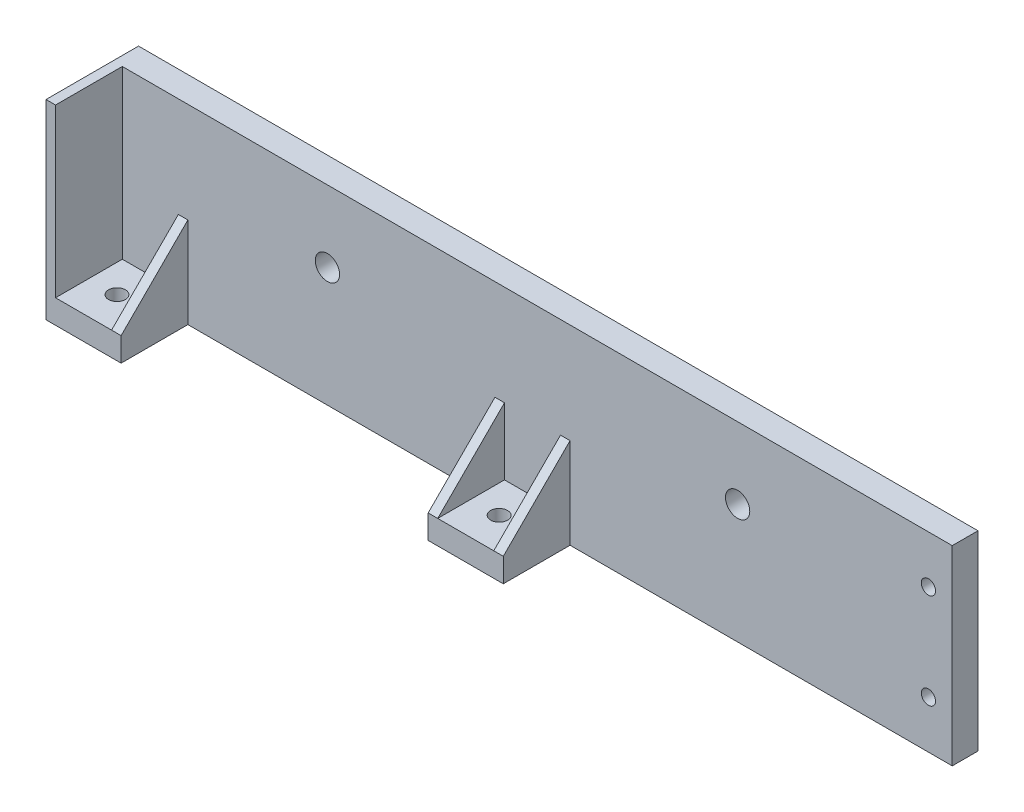
ISO-10303-21;
HEADER;
FILE_DESCRIPTION(('STEP AP214'),'2;1');
FILE_NAME('part.step','',(''),(''),'','','');
FILE_SCHEMA(('AUTOMOTIVE_DESIGN { 1 0 10303 214 1 1 1 1 }'));
ENDSEC;
DATA;
#1=APPLICATION_CONTEXT('core data for automotive mechanical design processes');
#2=APPLICATION_PROTOCOL_DEFINITION('international standard','automotive_design',2000,#1);
#3=PRODUCT_CONTEXT('',#1,'mechanical');
#4=PRODUCT('Part','Part','',(#3));
#5=PRODUCT_RELATED_PRODUCT_CATEGORY('part','',(#4));
#6=PRODUCT_DEFINITION_FORMATION('','',#4);
#7=PRODUCT_DEFINITION_CONTEXT('part definition',#1,'design');
#8=PRODUCT_DEFINITION('design','',#6,#7);
#9=PRODUCT_DEFINITION_SHAPE('','',#8);
#10=(LENGTH_UNIT() NAMED_UNIT(*) SI_UNIT(.MILLI.,.METRE.));
#11=(NAMED_UNIT(*) PLANE_ANGLE_UNIT() SI_UNIT($,.RADIAN.));
#12=(NAMED_UNIT(*) SI_UNIT($,.STERADIAN.) SOLID_ANGLE_UNIT());
#13=UNCERTAINTY_MEASURE_WITH_UNIT(LENGTH_MEASURE(1.E-05),#10,'distance_accuracy_value','');
#14=(GEOMETRIC_REPRESENTATION_CONTEXT(3) GLOBAL_UNCERTAINTY_ASSIGNED_CONTEXT((#13)) GLOBAL_UNIT_ASSIGNED_CONTEXT((#10,
#11,#12)) REPRESENTATION_CONTEXT('',''));
#15=CARTESIAN_POINT('',(0.,0.,0.));
#16=DIRECTION('',(0.,0.,1.));
#17=DIRECTION('',(1.,0.,0.));
#18=AXIS2_PLACEMENT_3D('',#15,#16,#17);
#19=CARTESIAN_POINT('',(0.,0.,6.858));
#20=DIRECTION('',(0.,0.,1.));
#21=DIRECTION('',(1.,0.,0.));
#22=AXIS2_PLACEMENT_3D('',#19,#20,#21);
#23=PLANE('',#22);
#24=CARTESIAN_POINT('',(105.41,12.7,6.858));
#25=DIRECTION('',(0.,0.,1.));
#26=DIRECTION('',(1.,0.,0.));
#27=AXIS2_PLACEMENT_3D('',#24,#25,#26);
#28=CIRCLE('',#27,1.89864999999999);
#29=CARTESIAN_POINT('',(107.30865,12.7,6.858));
#30=VERTEX_POINT('',#29);
#31=EDGE_CURVE('E40',#30,#30,#28,.T.);
#32=ORIENTED_EDGE('',*,*,#31,.F.);
#33=EDGE_LOOP('',(#32));
#34=FACE_BOUND('',#33,.T.);
#35=CARTESIAN_POINT('',(105.41,-12.7,6.858));
#36=DIRECTION('',(0.,0.,1.));
#37=DIRECTION('',(1.,0.,0.));
#38=AXIS2_PLACEMENT_3D('',#35,#36,#37);
#39=CIRCLE('',#38,1.89864999999999);
#40=CARTESIAN_POINT('',(107.30865,-12.7,6.858));
#41=VERTEX_POINT('',#40);
#42=EDGE_CURVE('E177',#41,#41,#39,.T.);
#43=ORIENTED_EDGE('',*,*,#42,.F.);
#44=EDGE_LOOP('',(#43));
#45=FACE_BOUND('',#44,.T.);
#46=CARTESIAN_POINT('',(-54.61,6.34999999999994,6.858));
#47=DIRECTION('',(0.,0.,1.));
#48=DIRECTION('',(1.,0.,0.));
#49=AXIS2_PLACEMENT_3D('',#46,#47,#48);
#50=CIRCLE('',#49,3.2385);
#51=CARTESIAN_POINT('',(-51.3715,6.34999999999994,6.858));
#52=VERTEX_POINT('',#51);
#53=EDGE_CURVE('E281',#52,#52,#50,.T.);
#54=ORIENTED_EDGE('',*,*,#53,.F.);
#55=EDGE_LOOP('',(#54));
#56=FACE_BOUND('',#55,.T.);
#57=CARTESIAN_POINT('',(54.61,6.35,6.858));
#58=DIRECTION('',(0.,0.,1.));
#59=DIRECTION('',(1.,0.,0.));
#60=AXIS2_PLACEMENT_3D('',#57,#58,#59);
#61=CIRCLE('',#60,3.2385);
#62=CARTESIAN_POINT('',(57.8485,6.35,6.858));
#63=VERTEX_POINT('',#62);
#64=EDGE_CURVE('E292',#63,#63,#61,.T.);
#65=ORIENTED_EDGE('',*,*,#64,.F.);
#66=EDGE_LOOP('',(#65));
#67=FACE_BOUND('',#66,.T.);
#68=DIRECTION('',(1.,0.,0.));
#69=VECTOR('',#68,1.);
#70=CARTESIAN_POINT('',(0.,25.4,6.858));
#71=LINE('',#70,#69);
#72=CARTESIAN_POINT('',(-109.22,25.4,6.858));
#73=VERTEX_POINT('',#72);
#74=CARTESIAN_POINT('',(111.76,25.4,6.858));
#75=VERTEX_POINT('',#74);
#76=EDGE_CURVE('E284',#73,#75,#71,.T.);
#77=ORIENTED_EDGE('',*,*,#76,.F.);
#78=DIRECTION('',(0.,-1.,0.));
#79=VECTOR('',#78,1.);
#80=CARTESIAN_POINT('',(-109.22,-1.27000000000001,6.858));
#81=LINE('',#80,#79);
#82=CARTESIAN_POINT('',(-109.22,-19.05,6.858));
#83=VERTEX_POINT('',#82);
#84=EDGE_CURVE('E261',#73,#83,#81,.T.);
#85=ORIENTED_EDGE('',*,*,#84,.T.);
#86=DIRECTION('',(-1.,0.,0.));
#87=VECTOR('',#86,1.);
#88=CARTESIAN_POINT('',(-111.76,-19.05,6.858));
#89=LINE('',#88,#87);
#90=CARTESIAN_POINT('',(-94.3,-19.05,6.858));
#91=VERTEX_POINT('',#90);
#92=EDGE_CURVE('E170',#91,#83,#89,.T.);
#93=ORIENTED_EDGE('',*,*,#92,.F.);
#94=DIRECTION('',(0.,-1.,0.));
#95=VECTOR('',#94,1.);
#96=CARTESIAN_POINT('',(-94.3,-1.27000000000001,6.858));
#97=LINE('',#96,#95);
#98=CARTESIAN_POINT('',(-94.3,-1.27000000000001,6.858));
#99=VERTEX_POINT('',#98);
#100=EDGE_CURVE('E254',#99,#91,#97,.T.);
#101=ORIENTED_EDGE('',*,*,#100,.F.);
#102=DIRECTION('',(-1.,0.,0.));
#103=VECTOR('',#102,1.);
#104=CARTESIAN_POINT('',(-91.76,-1.27000000000001,6.858));
#105=LINE('',#104,#103);
#106=CARTESIAN_POINT('',(-91.76,-1.27000000000001,6.858));
#107=VERTEX_POINT('',#106);
#108=EDGE_CURVE('E252',#107,#99,#105,.T.);
#109=ORIENTED_EDGE('',*,*,#108,.F.);
#110=DIRECTION('',(0.,1.,0.));
#111=VECTOR('',#110,1.);
#112=CARTESIAN_POINT('',(-91.76,-25.4,6.858));
#113=LINE('',#112,#111);
#114=CARTESIAN_POINT('',(-91.76,-25.4,6.858));
#115=VERTEX_POINT('',#114);
#116=EDGE_CURVE('E58',#115,#107,#113,.T.);
#117=ORIENTED_EDGE('',*,*,#116,.F.);
#118=DIRECTION('',(1.,0.,0.));
#119=VECTOR('',#118,1.);
#120=CARTESIAN_POINT('',(0.,-25.4,6.858));
#121=LINE('',#120,#119);
#122=CARTESIAN_POINT('',(-10.,-25.4,6.858));
#123=VERTEX_POINT('',#122);
#124=EDGE_CURVE('E53',#115,#123,#121,.T.);
#125=ORIENTED_EDGE('',*,*,#124,.T.);
#126=DIRECTION('',(0.,-1.,0.));
#127=VECTOR('',#126,1.);
#128=CARTESIAN_POINT('',(-10.,-25.4,6.858));
#129=LINE('',#128,#127);
#130=CARTESIAN_POINT('',(-10.,-1.27000000000001,6.858));
#131=VERTEX_POINT('',#130);
#132=EDGE_CURVE('E220',#131,#123,#129,.T.);
#133=ORIENTED_EDGE('',*,*,#132,.F.);
#134=DIRECTION('',(-1.,0.,0.));
#135=VECTOR('',#134,1.);
#136=CARTESIAN_POINT('',(-10.,-1.27000000000001,6.858));
#137=LINE('',#136,#135);
#138=CARTESIAN_POINT('',(-7.46000000000002,-1.27000000000001,6.858));
#139=VERTEX_POINT('',#138);
#140=EDGE_CURVE('E207',#139,#131,#137,.T.);
#141=ORIENTED_EDGE('',*,*,#140,.F.);
#142=DIRECTION('',(0.,-1.,0.));
#143=VECTOR('',#142,1.);
#144=CARTESIAN_POINT('',(-7.46000000000002,-1.27000000000001,6.858));
#145=LINE('',#144,#143);
#146=CARTESIAN_POINT('',(-7.46000000000002,-19.05,6.858));
#147=VERTEX_POINT('',#146);
#148=EDGE_CURVE('E209',#139,#147,#145,.T.);
#149=ORIENTED_EDGE('',*,*,#148,.T.);
#150=DIRECTION('',(-1.,0.,0.));
#151=VECTOR('',#150,1.);
#152=CARTESIAN_POINT('',(-10.,-19.05,6.858));
#153=LINE('',#152,#151);
#154=CARTESIAN_POINT('',(7.45999999999998,-19.05,6.858));
#155=VERTEX_POINT('',#154);
#156=EDGE_CURVE('E224',#155,#147,#153,.T.);
#157=ORIENTED_EDGE('',*,*,#156,.F.);
#158=DIRECTION('',(0.,-1.,0.));
#159=VECTOR('',#158,1.);
#160=CARTESIAN_POINT('',(7.45999999999998,-1.27000000000001,6.858));
#161=LINE('',#160,#159);
#162=CARTESIAN_POINT('',(7.45999999999998,-1.27000000000001,6.858));
#163=VERTEX_POINT('',#162);
#164=EDGE_CURVE('E202',#163,#155,#161,.T.);
#165=ORIENTED_EDGE('',*,*,#164,.F.);
#166=DIRECTION('',(-1.,0.,0.));
#167=VECTOR('',#166,1.);
#168=CARTESIAN_POINT('',(9.99999999999998,-1.27000000000001,6.858));
#169=LINE('',#168,#167);
#170=CARTESIAN_POINT('',(9.99999999999998,-1.27000000000001,6.858));
#171=VERTEX_POINT('',#170);
#172=EDGE_CURVE('E200',#171,#163,#169,.T.);
#173=ORIENTED_EDGE('',*,*,#172,.F.);
#174=DIRECTION('',(0.,1.,0.));
#175=VECTOR('',#174,1.);
#176=CARTESIAN_POINT('',(9.99999999999998,-25.4,6.858));
#177=LINE('',#176,#175);
#178=CARTESIAN_POINT('',(9.99999999999998,-25.4,6.858));
#179=VERTEX_POINT('',#178);
#180=EDGE_CURVE('E235',#179,#171,#177,.T.);
#181=ORIENTED_EDGE('',*,*,#180,.F.);
#182=CARTESIAN_POINT('',(111.76,-25.4,6.858));
#183=VERTEX_POINT('',#182);
#184=EDGE_CURVE('E287',#179,#183,#121,.T.);
#185=ORIENTED_EDGE('',*,*,#184,.T.);
#186=DIRECTION('',(0.,1.,0.));
#187=VECTOR('',#186,1.);
#188=CARTESIAN_POINT('',(111.76,0.,6.858));
#189=LINE('',#188,#187);
#190=EDGE_CURVE('E289',#183,#75,#189,.T.);
#191=ORIENTED_EDGE('',*,*,#190,.T.);
#192=EDGE_LOOP('',(#77,#85,#93,#101,#109,#117,#125,#133,#141,#149,#157,#165,#173,#181,#185,#191));
#193=FACE_BOUND('',#192,.T.);
#194=ADVANCED_FACE('F36',(#34,#45,#56,#67,#193),#23,.T.);
#195=CARTESIAN_POINT('',(-10.,-19.05,24.638));
#196=DIRECTION('',(0.,-1.,0.));
#197=DIRECTION('',(0.,0.,-1.));
#198=AXIS2_PLACEMENT_3D('',#195,#196,#197);
#199=PLANE('',#198);
#200=CARTESIAN_POINT('',(0.,-19.05,15.748));
#201=DIRECTION('',(0.,1.,0.));
#202=DIRECTION('',(0.,0.,1.));
#203=AXIS2_PLACEMENT_3D('',#200,#201,#202);
#204=CIRCLE('',#203,2.25);
#205=CARTESIAN_POINT('',(0.,-19.05,17.998));
#206=VERTEX_POINT('',#205);
#207=EDGE_CURVE('E214',#206,#206,#204,.T.);
#208=ORIENTED_EDGE('',*,*,#207,.F.);
#209=EDGE_LOOP('',(#208));
#210=FACE_BOUND('',#209,.T.);
#211=DIRECTION('',(0.,0.,1.));
#212=VECTOR('',#211,1.);
#213=CARTESIAN_POINT('',(7.45999999999998,-19.05,24.638));
#214=LINE('',#213,#212);
#215=CARTESIAN_POINT('',(7.45999999999998,-19.05,24.638));
#216=VERTEX_POINT('',#215);
#217=EDGE_CURVE('E199',#155,#216,#214,.T.);
#218=ORIENTED_EDGE('',*,*,#217,.F.);
#219=ORIENTED_EDGE('',*,*,#156,.T.);
#220=DIRECTION('',(0.,0.,-1.));
#221=VECTOR('',#220,1.);
#222=CARTESIAN_POINT('',(-7.46000000000002,-19.05,24.638));
#223=LINE('',#222,#221);
#224=CARTESIAN_POINT('',(-7.46000000000002,-19.05,24.638));
#225=VERTEX_POINT('',#224);
#226=EDGE_CURVE('E206',#225,#147,#223,.T.);
#227=ORIENTED_EDGE('',*,*,#226,.F.);
#228=DIRECTION('',(-1.,0.,0.));
#229=VECTOR('',#228,1.);
#230=CARTESIAN_POINT('',(-10.,-19.05,24.638));
#231=LINE('',#230,#229);
#232=EDGE_CURVE('E229',#216,#225,#231,.T.);
#233=ORIENTED_EDGE('',*,*,#232,.F.);
#234=EDGE_LOOP('',(#218,#219,#227,#233));
#235=FACE_BOUND('',#234,.T.);
#236=ADVANCED_FACE('F354',(#210,#235),#199,.F.);
#237=CARTESIAN_POINT('',(-111.76,-19.05,24.638));
#238=DIRECTION('',(0.,-1.,0.));
#239=DIRECTION('',(0.,0.,-1.));
#240=AXIS2_PLACEMENT_3D('',#237,#238,#239);
#241=PLANE('',#240);
#242=CARTESIAN_POINT('',(-101.76,-19.05,15.748));
#243=DIRECTION('',(0.,1.,0.));
#244=DIRECTION('',(0.,0.,1.));
#245=AXIS2_PLACEMENT_3D('',#242,#243,#244);
#246=CIRCLE('',#245,2.25);
#247=CARTESIAN_POINT('',(-101.76,-19.05,17.998));
#248=VERTEX_POINT('',#247);
#249=EDGE_CURVE('E264',#248,#248,#246,.T.);
#250=ORIENTED_EDGE('',*,*,#249,.F.);
#251=EDGE_LOOP('',(#250));
#252=FACE_BOUND('',#251,.T.);
#253=DIRECTION('',(0.,0.,1.));
#254=VECTOR('',#253,1.);
#255=CARTESIAN_POINT('',(-94.3,-19.05,24.638));
#256=LINE('',#255,#254);
#257=CARTESIAN_POINT('',(-94.3,-19.05,24.638));
#258=VERTEX_POINT('',#257);
#259=EDGE_CURVE('E251',#91,#258,#256,.T.);
#260=ORIENTED_EDGE('',*,*,#259,.F.);
#261=ORIENTED_EDGE('',*,*,#92,.T.);
#262=DIRECTION('',(0.,0.,-1.));
#263=VECTOR('',#262,1.);
#264=CARTESIAN_POINT('',(-109.22,-19.05,24.638));
#265=LINE('',#264,#263);
#266=CARTESIAN_POINT('',(-109.22,-19.05,24.638));
#267=VERTEX_POINT('',#266);
#268=EDGE_CURVE('E258',#267,#83,#265,.T.);
#269=ORIENTED_EDGE('',*,*,#268,.F.);
#270=DIRECTION('',(-1.,0.,0.));
#271=VECTOR('',#270,1.);
#272=CARTESIAN_POINT('',(-111.76,-19.05,24.638));
#273=LINE('',#272,#271);
#274=EDGE_CURVE('E273',#258,#267,#273,.T.);
#275=ORIENTED_EDGE('',*,*,#274,.F.);
#276=EDGE_LOOP('',(#260,#261,#269,#275));
#277=FACE_BOUND('',#276,.T.);
#278=ADVANCED_FACE('F374',(#252,#277),#241,.F.);
#279=CARTESIAN_POINT('',(0.,25.4,6.858));
#280=DIRECTION('',(0.,1.,0.));
#281=DIRECTION('',(0.,0.,1.));
#282=AXIS2_PLACEMENT_3D('',#279,#280,#281);
#283=PLANE('',#282);
#284=DIRECTION('',(1.,0.,0.));
#285=VECTOR('',#284,1.);
#286=CARTESIAN_POINT('',(0.,25.4,0.));
#287=LINE('',#286,#285);
#288=CARTESIAN_POINT('',(-111.76,25.4,0.));
#289=VERTEX_POINT('',#288);
#290=CARTESIAN_POINT('',(111.76,25.4,0.));
#291=VERTEX_POINT('',#290);
#292=EDGE_CURVE('E160',#289,#291,#287,.T.);
#293=ORIENTED_EDGE('',*,*,#292,.F.);
#294=DIRECTION('',(0.,0.,-1.));
#295=VECTOR('',#294,1.);
#296=CARTESIAN_POINT('',(-111.76,25.4,6.858));
#297=LINE('',#296,#295);
#298=CARTESIAN_POINT('',(-111.76,25.4,24.638));
#299=VERTEX_POINT('',#298);
#300=EDGE_CURVE('E11',#299,#289,#297,.T.);
#301=ORIENTED_EDGE('',*,*,#300,.F.);
#302=DIRECTION('',(-1.,0.,0.));
#303=VECTOR('',#302,1.);
#304=CARTESIAN_POINT('',(-61.3458848645743,25.4,24.638));
#305=LINE('',#304,#303);
#306=CARTESIAN_POINT('',(-109.22,25.4,24.638));
#307=VERTEX_POINT('',#306);
#308=EDGE_CURVE('E157',#307,#299,#305,.T.);
#309=ORIENTED_EDGE('',*,*,#308,.F.);
#310=DIRECTION('',(0.,0.,1.));
#311=VECTOR('',#310,1.);
#312=CARTESIAN_POINT('',(-109.22,25.4,6.858));
#313=LINE('',#312,#311);
#314=EDGE_CURVE('E176',#73,#307,#313,.T.);
#315=ORIENTED_EDGE('',*,*,#314,.F.);
#316=ORIENTED_EDGE('',*,*,#76,.T.);
#317=DIRECTION('',(0.,0.,-1.));
#318=VECTOR('',#317,1.);
#319=CARTESIAN_POINT('',(111.76,25.4,6.858));
#320=LINE('',#319,#318);
#321=EDGE_CURVE('E295',#75,#291,#320,.T.);
#322=ORIENTED_EDGE('',*,*,#321,.T.);
#323=EDGE_LOOP('',(#293,#301,#309,#315,#316,#322));
#324=FACE_BOUND('',#323,.T.);
#325=ADVANCED_FACE('F154',(#324),#283,.T.);
#326=CARTESIAN_POINT('',(-111.76,0.,6.858));
#327=DIRECTION('',(-1.,0.,0.));
#328=DIRECTION('',(0.,0.,1.));
#329=AXIS2_PLACEMENT_3D('',#326,#327,#328);
#330=PLANE('',#329);
#331=DIRECTION('',(0.,-1.,0.));
#332=VECTOR('',#331,1.);
#333=CARTESIAN_POINT('',(-111.76,-25.4,24.638));
#334=LINE('',#333,#332);
#335=CARTESIAN_POINT('',(-111.76,-25.4,24.638));
#336=VERTEX_POINT('',#335);
#337=EDGE_CURVE('E165',#299,#336,#334,.T.);
#338=ORIENTED_EDGE('',*,*,#337,.F.);
#339=ORIENTED_EDGE('',*,*,#300,.T.);
#340=DIRECTION('',(0.,1.,0.));
#341=VECTOR('',#340,1.);
#342=CARTESIAN_POINT('',(-111.76,0.,0.));
#343=LINE('',#342,#341);
#344=CARTESIAN_POINT('',(-111.76,-25.4,0.));
#345=VERTEX_POINT('',#344);
#346=EDGE_CURVE('E299',#345,#289,#343,.T.);
#347=ORIENTED_EDGE('',*,*,#346,.F.);
#348=DIRECTION('',(0.,0.,-1.));
#349=VECTOR('',#348,1.);
#350=CARTESIAN_POINT('',(-111.76,-25.4,6.858));
#351=LINE('',#350,#349);
#352=EDGE_CURVE('E45',#336,#345,#351,.T.);
#353=ORIENTED_EDGE('',*,*,#352,.F.);
#354=EDGE_LOOP('',(#338,#339,#347,#353));
#355=FACE_BOUND('',#354,.T.);
#356=ADVANCED_FACE('F166',(#355),#330,.T.);
#357=CARTESIAN_POINT('',(0.,-25.4,6.858));
#358=DIRECTION('',(0.,1.,0.));
#359=DIRECTION('',(0.,0.,1.));
#360=AXIS2_PLACEMENT_3D('',#357,#358,#359);
#361=PLANE('',#360);
#362=CARTESIAN_POINT('',(0.,-25.4,15.748));
#363=DIRECTION('',(0.,1.,0.));
#364=DIRECTION('',(0.,0.,1.));
#365=AXIS2_PLACEMENT_3D('',#362,#363,#364);
#366=CIRCLE('',#365,2.25);
#367=CARTESIAN_POINT('',(0.,-25.4,17.998));
#368=VERTEX_POINT('',#367);
#369=EDGE_CURVE('E217',#368,#368,#366,.T.);
#370=ORIENTED_EDGE('',*,*,#369,.T.);
#371=EDGE_LOOP('',(#370));
#372=FACE_BOUND('',#371,.T.);
#373=CARTESIAN_POINT('',(-101.76,-25.4,15.748));
#374=DIRECTION('',(0.,1.,0.));
#375=DIRECTION('',(0.,0.,1.));
#376=AXIS2_PLACEMENT_3D('',#373,#374,#375);
#377=CIRCLE('',#376,2.25);
#378=CARTESIAN_POINT('',(-101.76,-25.4,17.998));
#379=VERTEX_POINT('',#378);
#380=EDGE_CURVE('E267',#379,#379,#377,.T.);
#381=ORIENTED_EDGE('',*,*,#380,.T.);
#382=EDGE_LOOP('',(#381));
#383=FACE_BOUND('',#382,.T.);
#384=DIRECTION('',(1.,0.,0.));
#385=VECTOR('',#384,1.);
#386=CARTESIAN_POINT('',(0.,-25.4,0.));
#387=LINE('',#386,#385);
#388=CARTESIAN_POINT('',(111.76,-25.4,0.));
#389=VERTEX_POINT('',#388);
#390=EDGE_CURVE('E301',#345,#389,#387,.T.);
#391=ORIENTED_EDGE('',*,*,#390,.T.);
#392=DIRECTION('',(0.,0.,-1.));
#393=VECTOR('',#392,1.);
#394=CARTESIAN_POINT('',(111.76,-25.4,6.858));
#395=LINE('',#394,#393);
#396=EDGE_CURVE('E310',#183,#389,#395,.T.);
#397=ORIENTED_EDGE('',*,*,#396,.F.);
#398=ORIENTED_EDGE('',*,*,#184,.F.);
#399=DIRECTION('',(0.,0.,-1.));
#400=VECTOR('',#399,1.);
#401=CARTESIAN_POINT('',(9.99999999999998,-25.4,24.638));
#402=LINE('',#401,#400);
#403=CARTESIAN_POINT('',(9.99999999999998,-25.4,24.638));
#404=VERTEX_POINT('',#403);
#405=EDGE_CURVE('E232',#404,#179,#402,.T.);
#406=ORIENTED_EDGE('',*,*,#405,.F.);
#407=DIRECTION('',(1.,0.,0.));
#408=VECTOR('',#407,1.);
#409=CARTESIAN_POINT('',(-10.,-25.4,24.638));
#410=LINE('',#409,#408);
#411=CARTESIAN_POINT('',(-10.,-25.4,24.638));
#412=VERTEX_POINT('',#411);
#413=EDGE_CURVE('E223',#412,#404,#410,.T.);
#414=ORIENTED_EDGE('',*,*,#413,.F.);
#415=DIRECTION('',(0.,0.,-1.));
#416=VECTOR('',#415,1.);
#417=CARTESIAN_POINT('',(-10.,-25.4,24.638));
#418=LINE('',#417,#416);
#419=EDGE_CURVE('E241',#412,#123,#418,.T.);
#420=ORIENTED_EDGE('',*,*,#419,.T.);
#421=ORIENTED_EDGE('',*,*,#124,.F.);
#422=DIRECTION('',(0.,0.,-1.));
#423=VECTOR('',#422,1.);
#424=CARTESIAN_POINT('',(-91.76,-25.4,24.638));
#425=LINE('',#424,#423);
#426=CARTESIAN_POINT('',(-91.76,-25.4,24.638));
#427=VERTEX_POINT('',#426);
#428=EDGE_CURVE('E275',#427,#115,#425,.T.);
#429=ORIENTED_EDGE('',*,*,#428,.F.);
#430=DIRECTION('',(1.,0.,0.));
#431=VECTOR('',#430,1.);
#432=CARTESIAN_POINT('',(-111.76,-25.4,24.638));
#433=LINE('',#432,#431);
#434=EDGE_CURVE('E169',#336,#427,#433,.T.);
#435=ORIENTED_EDGE('',*,*,#434,.F.);
#436=ORIENTED_EDGE('',*,*,#352,.T.);
#437=EDGE_LOOP('',(#391,#397,#398,#406,#414,#420,#421,#429,#435,#436));
#438=FACE_BOUND('',#437,.T.);
#439=ADVANCED_FACE('F315',(#372,#383,#438),#361,.F.);
#440=CARTESIAN_POINT('',(111.76,0.,6.858));
#441=DIRECTION('',(-1.,0.,0.));
#442=DIRECTION('',(0.,0.,1.));
#443=AXIS2_PLACEMENT_3D('',#440,#441,#442);
#444=PLANE('',#443);
#445=DIRECTION('',(0.,1.,0.));
#446=VECTOR('',#445,1.);
#447=CARTESIAN_POINT('',(111.76,0.,0.));
#448=LINE('',#447,#446);
#449=EDGE_CURVE('E304',#389,#291,#448,.T.);
#450=ORIENTED_EDGE('',*,*,#449,.T.);
#451=ORIENTED_EDGE('',*,*,#321,.F.);
#452=ORIENTED_EDGE('',*,*,#190,.F.);
#453=ORIENTED_EDGE('',*,*,#396,.T.);
#454=EDGE_LOOP('',(#450,#451,#452,#453));
#455=FACE_BOUND('',#454,.T.);
#456=ADVANCED_FACE('F324',(#455),#444,.F.);
#457=CARTESIAN_POINT('',(-54.61,6.34999999999994,6.858));
#458=DIRECTION('',(0.,0.,-1.));
#459=DIRECTION('',(-1.,0.,0.));
#460=AXIS2_PLACEMENT_3D('',#457,#458,#459);
#461=CYLINDRICAL_SURFACE('',#460,3.2385);
#462=ORIENTED_EDGE('',*,*,#53,.T.);
#463=EDGE_LOOP('',(#462));
#464=FACE_BOUND('',#463,.T.);
#465=CARTESIAN_POINT('',(-54.61,6.34999999999994,0.));
#466=DIRECTION('',(0.,0.,1.));
#467=DIRECTION('',(1.,0.,0.));
#468=AXIS2_PLACEMENT_3D('',#465,#466,#467);
#469=CIRCLE('',#468,3.2385);
#470=CARTESIAN_POINT('',(-51.3715,6.34999999999994,0.));
#471=VERTEX_POINT('',#470);
#472=EDGE_CURVE('E280',#471,#471,#469,.T.);
#473=ORIENTED_EDGE('',*,*,#472,.F.);
#474=EDGE_LOOP('',(#473));
#475=FACE_BOUND('',#474,.T.);
#476=ADVANCED_FACE('F38',(#464,#475),#461,.F.);
#477=CARTESIAN_POINT('',(54.61,6.35,6.858));
#478=DIRECTION('',(0.,0.,-1.));
#479=DIRECTION('',(-1.,0.,0.));
#480=AXIS2_PLACEMENT_3D('',#477,#478,#479);
#481=CYLINDRICAL_SURFACE('',#480,3.2385);
#482=ORIENTED_EDGE('',*,*,#64,.T.);
#483=EDGE_LOOP('',(#482));
#484=FACE_BOUND('',#483,.T.);
#485=CARTESIAN_POINT('',(54.61,6.35,0.));
#486=DIRECTION('',(0.,0.,1.));
#487=DIRECTION('',(1.,0.,0.));
#488=AXIS2_PLACEMENT_3D('',#485,#486,#487);
#489=CIRCLE('',#488,3.2385);
#490=CARTESIAN_POINT('',(57.8485,6.35,0.));
#491=VERTEX_POINT('',#490);
#492=EDGE_CURVE('E285',#491,#491,#489,.T.);
#493=ORIENTED_EDGE('',*,*,#492,.F.);
#494=EDGE_LOOP('',(#493));
#495=FACE_BOUND('',#494,.T.);
#496=ADVANCED_FACE('F385',(#484,#495),#481,.F.);
#497=CARTESIAN_POINT('',(0.,0.,0.));
#498=DIRECTION('',(0.,0.,1.));
#499=DIRECTION('',(1.,0.,0.));
#500=AXIS2_PLACEMENT_3D('',#497,#498,#499);
#501=PLANE('',#500);
#502=CARTESIAN_POINT('',(105.41,12.7,0.));
#503=DIRECTION('',(0.,0.,-1.));
#504=DIRECTION('',(-1.,0.,0.));
#505=AXIS2_PLACEMENT_3D('',#502,#503,#504);
#506=CIRCLE('',#505,3.98489170000001);
#507=CARTESIAN_POINT('',(101.4251083,12.7,0.));
#508=VERTEX_POINT('',#507);
#509=EDGE_CURVE('E548',#508,#508,#506,.T.);
#510=ORIENTED_EDGE('',*,*,#509,.F.);
#511=EDGE_LOOP('',(#510));
#512=FACE_BOUND('',#511,.T.);
#513=CARTESIAN_POINT('',(105.41,-12.7,0.));
#514=DIRECTION('',(0.,0.,-1.));
#515=DIRECTION('',(-1.,0.,0.));
#516=AXIS2_PLACEMENT_3D('',#513,#514,#515);
#517=CIRCLE('',#516,3.98489169999999);
#518=CARTESIAN_POINT('',(101.4251083,-12.7,0.));
#519=VERTEX_POINT('',#518);
#520=EDGE_CURVE('E552',#519,#519,#517,.T.);
#521=ORIENTED_EDGE('',*,*,#520,.F.);
#522=EDGE_LOOP('',(#521));
#523=FACE_BOUND('',#522,.T.);
#524=ORIENTED_EDGE('',*,*,#472,.T.);
#525=EDGE_LOOP('',(#524));
#526=FACE_BOUND('',#525,.T.);
#527=ORIENTED_EDGE('',*,*,#292,.T.);
#528=ORIENTED_EDGE('',*,*,#449,.F.);
#529=ORIENTED_EDGE('',*,*,#390,.F.);
#530=ORIENTED_EDGE('',*,*,#346,.T.);
#531=EDGE_LOOP('',(#527,#528,#529,#530));
#532=FACE_BOUND('',#531,.T.);
#533=ORIENTED_EDGE('',*,*,#492,.T.);
#534=EDGE_LOOP('',(#533));
#535=FACE_BOUND('',#534,.T.);
#536=ADVANCED_FACE('F319',(#512,#523,#526,#532,#535),#501,.F.);
#537=CARTESIAN_POINT('',(-91.76,-25.4,24.638));
#538=DIRECTION('',(-1.,0.,0.));
#539=DIRECTION('',(0.,0.,1.));
#540=AXIS2_PLACEMENT_3D('',#537,#538,#539);
#541=PLANE('',#540);
#542=ORIENTED_EDGE('',*,*,#116,.T.);
#543=DIRECTION('',(0.,0.707106781186547,-0.707106781186548));
#544=VECTOR('',#543,1.);
#545=CARTESIAN_POINT('',(-91.76,-19.05,24.638));
#546=LINE('',#545,#544);
#547=CARTESIAN_POINT('',(-91.76,-19.05,24.638));
#548=VERTEX_POINT('',#547);
#549=EDGE_CURVE('E244',#548,#107,#546,.T.);
#550=ORIENTED_EDGE('',*,*,#549,.F.);
#551=DIRECTION('',(0.,1.,0.));
#552=VECTOR('',#551,1.);
#553=CARTESIAN_POINT('',(-91.76,-25.4,24.638));
#554=LINE('',#553,#552);
#555=EDGE_CURVE('E271',#427,#548,#554,.T.);
#556=ORIENTED_EDGE('',*,*,#555,.F.);
#557=ORIENTED_EDGE('',*,*,#428,.T.);
#558=EDGE_LOOP('',(#542,#550,#556,#557));
#559=FACE_BOUND('',#558,.T.);
#560=ADVANCED_FACE('F381',(#559),#541,.F.);
#561=CARTESIAN_POINT('',(0.,0.,24.638));
#562=DIRECTION('',(0.,0.,-1.));
#563=DIRECTION('',(-1.,0.,0.));
#564=AXIS2_PLACEMENT_3D('',#561,#562,#563);
#565=PLANE('',#564);
#566=ORIENTED_EDGE('',*,*,#555,.T.);
#567=DIRECTION('',(-1.,0.,0.));
#568=VECTOR('',#567,1.);
#569=CARTESIAN_POINT('',(-66.6152828610064,-19.05,24.638));
#570=LINE('',#569,#568);
#571=EDGE_CURVE('E243',#548,#258,#570,.T.);
#572=ORIENTED_EDGE('',*,*,#571,.T.);
#573=ORIENTED_EDGE('',*,*,#274,.T.);
#574=DIRECTION('',(0.,-1.,0.));
#575=VECTOR('',#574,1.);
#576=CARTESIAN_POINT('',(-109.22,-19.05,24.638));
#577=LINE('',#576,#575);
#578=EDGE_CURVE('E175',#307,#267,#577,.T.);
#579=ORIENTED_EDGE('',*,*,#578,.F.);
#580=ORIENTED_EDGE('',*,*,#308,.T.);
#581=ORIENTED_EDGE('',*,*,#337,.T.);
#582=ORIENTED_EDGE('',*,*,#434,.T.);
#583=EDGE_LOOP('',(#566,#572,#573,#579,#580,#581,#582));
#584=FACE_BOUND('',#583,.T.);
#585=ADVANCED_FACE('F173',(#584),#565,.F.);
#586=CARTESIAN_POINT('',(-101.76,-36.83,15.748));
#587=DIRECTION('',(0.,1.,0.));
#588=DIRECTION('',(0.,0.,1.));
#589=AXIS2_PLACEMENT_3D('',#586,#587,#588);
#590=CYLINDRICAL_SURFACE('',#589,2.25);
#591=ORIENTED_EDGE('',*,*,#249,.T.);
#592=EDGE_LOOP('',(#591));
#593=FACE_BOUND('',#592,.T.);
#594=ORIENTED_EDGE('',*,*,#380,.F.);
#595=EDGE_LOOP('',(#594));
#596=FACE_BOUND('',#595,.T.);
#597=ADVANCED_FACE('F408',(#593,#596),#590,.F.);
#598=CARTESIAN_POINT('',(-109.22,-1.27000000000001,24.638));
#599=DIRECTION('',(-1.,0.,0.));
#600=DIRECTION('',(0.,0.,1.));
#601=AXIS2_PLACEMENT_3D('',#598,#599,#600);
#602=PLANE('',#601);
#603=ORIENTED_EDGE('',*,*,#84,.F.);
#604=ORIENTED_EDGE('',*,*,#314,.T.);
#605=ORIENTED_EDGE('',*,*,#578,.T.);
#606=ORIENTED_EDGE('',*,*,#268,.T.);
#607=EDGE_LOOP('',(#603,#604,#605,#606));
#608=FACE_BOUND('',#607,.T.);
#609=ADVANCED_FACE('F411',(#608),#602,.F.);
#610=CARTESIAN_POINT('',(-94.3,-1.27000000000001,24.638));
#611=DIRECTION('',(1.,0.,0.));
#612=DIRECTION('',(0.,0.,-1.));
#613=AXIS2_PLACEMENT_3D('',#610,#611,#612);
#614=PLANE('',#613);
#615=ORIENTED_EDGE('',*,*,#259,.T.);
#616=DIRECTION('',(0.,0.707106781186547,-0.707106781186548));
#617=VECTOR('',#616,1.);
#618=CARTESIAN_POINT('',(-94.3,-10.16,15.748));
#619=LINE('',#618,#617);
#620=EDGE_CURVE('E246',#258,#99,#619,.T.);
#621=ORIENTED_EDGE('',*,*,#620,.T.);
#622=ORIENTED_EDGE('',*,*,#100,.T.);
#623=EDGE_LOOP('',(#615,#621,#622));
#624=FACE_BOUND('',#623,.T.);
#625=ADVANCED_FACE('F415',(#624),#614,.F.);
#626=CARTESIAN_POINT('',(-66.6152828610064,-19.05,24.638));
#627=DIRECTION('',(0.,-0.707106781186548,-0.707106781186547));
#628=DIRECTION('',(0.,0.707106781186547,-0.707106781186548));
#629=AXIS2_PLACEMENT_3D('',#626,#627,#628);
#630=PLANE('',#629);
#631=ORIENTED_EDGE('',*,*,#571,.F.);
#632=ORIENTED_EDGE('',*,*,#549,.T.);
#633=ORIENTED_EDGE('',*,*,#108,.T.);
#634=ORIENTED_EDGE('',*,*,#620,.F.);
#635=EDGE_LOOP('',(#631,#632,#633,#634));
#636=FACE_BOUND('',#635,.T.);
#637=ADVANCED_FACE('F419',(#636),#630,.F.);
#638=CARTESIAN_POINT('',(-10.,-25.4,24.638));
#639=DIRECTION('',(1.,0.,0.));
#640=DIRECTION('',(0.,0.,-1.));
#641=AXIS2_PLACEMENT_3D('',#638,#639,#640);
#642=PLANE('',#641);
#643=DIRECTION('',(0.,-1.,0.));
#644=VECTOR('',#643,1.);
#645=CARTESIAN_POINT('',(-10.,-25.4,24.638));
#646=LINE('',#645,#644);
#647=CARTESIAN_POINT('',(-10.,-19.05,24.638));
#648=VERTEX_POINT('',#647);
#649=EDGE_CURVE('E221',#648,#412,#646,.T.);
#650=ORIENTED_EDGE('',*,*,#649,.F.);
#651=DIRECTION('',(0.,-0.707106781186547,0.707106781186548));
#652=VECTOR('',#651,1.);
#653=CARTESIAN_POINT('',(-10.,-19.05,24.638));
#654=LINE('',#653,#652);
#655=EDGE_CURVE('E185',#131,#648,#654,.T.);
#656=ORIENTED_EDGE('',*,*,#655,.F.);
#657=ORIENTED_EDGE('',*,*,#132,.T.);
#658=ORIENTED_EDGE('',*,*,#419,.F.);
#659=EDGE_LOOP('',(#650,#656,#657,#658));
#660=FACE_BOUND('',#659,.T.);
#661=ADVANCED_FACE('F341',(#660),#642,.F.);
#662=CARTESIAN_POINT('',(9.99999999999998,-25.4,24.638));
#663=DIRECTION('',(-1.,0.,0.));
#664=DIRECTION('',(0.,0.,1.));
#665=AXIS2_PLACEMENT_3D('',#662,#663,#664);
#666=PLANE('',#665);
#667=ORIENTED_EDGE('',*,*,#180,.T.);
#668=DIRECTION('',(0.,0.707106781186547,-0.707106781186548));
#669=VECTOR('',#668,1.);
#670=CARTESIAN_POINT('',(9.99999999999998,-19.05,24.638));
#671=LINE('',#670,#669);
#672=CARTESIAN_POINT('',(9.99999999999998,-19.05,24.638));
#673=VERTEX_POINT('',#672);
#674=EDGE_CURVE('E186',#673,#171,#671,.T.);
#675=ORIENTED_EDGE('',*,*,#674,.F.);
#676=DIRECTION('',(0.,1.,0.));
#677=VECTOR('',#676,1.);
#678=CARTESIAN_POINT('',(9.99999999999998,-25.4,24.638));
#679=LINE('',#678,#677);
#680=EDGE_CURVE('E226',#404,#673,#679,.T.);
#681=ORIENTED_EDGE('',*,*,#680,.F.);
#682=ORIENTED_EDGE('',*,*,#405,.T.);
#683=EDGE_LOOP('',(#667,#675,#681,#682));
#684=FACE_BOUND('',#683,.T.);
#685=ADVANCED_FACE('F334',(#684),#666,.F.);
#686=CARTESIAN_POINT('',(101.76,0.,24.638));
#687=DIRECTION('',(0.,0.,-1.));
#688=DIRECTION('',(-1.,0.,0.));
#689=AXIS2_PLACEMENT_3D('',#686,#687,#688);
#690=PLANE('',#689);
#691=ORIENTED_EDGE('',*,*,#680,.T.);
#692=DIRECTION('',(-1.,0.,0.));
#693=VECTOR('',#692,1.);
#694=CARTESIAN_POINT('',(96.9047171389936,-19.05,24.638));
#695=LINE('',#694,#693);
#696=EDGE_CURVE('E189',#673,#216,#695,.T.);
#697=ORIENTED_EDGE('',*,*,#696,.T.);
#698=ORIENTED_EDGE('',*,*,#232,.T.);
#699=EDGE_CURVE('E191',#225,#648,#695,.T.);
#700=ORIENTED_EDGE('',*,*,#699,.T.);
#701=ORIENTED_EDGE('',*,*,#649,.T.);
#702=ORIENTED_EDGE('',*,*,#413,.T.);
#703=EDGE_LOOP('',(#691,#697,#698,#700,#701,#702));
#704=FACE_BOUND('',#703,.T.);
#705=ADVANCED_FACE('F336',(#704),#690,.F.);
#706=CARTESIAN_POINT('',(0.,-36.83,15.748));
#707=DIRECTION('',(0.,1.,0.));
#708=DIRECTION('',(0.,0.,1.));
#709=AXIS2_PLACEMENT_3D('',#706,#707,#708);
#710=CYLINDRICAL_SURFACE('',#709,2.25);
#711=ORIENTED_EDGE('',*,*,#207,.T.);
#712=EDGE_LOOP('',(#711));
#713=FACE_BOUND('',#712,.T.);
#714=ORIENTED_EDGE('',*,*,#369,.F.);
#715=EDGE_LOOP('',(#714));
#716=FACE_BOUND('',#715,.T.);
#717=ADVANCED_FACE('F430',(#713,#716),#710,.F.);
#718=CARTESIAN_POINT('',(-7.46000000000002,-1.27000000000001,24.638));
#719=DIRECTION('',(-1.,0.,0.));
#720=DIRECTION('',(0.,0.,1.));
#721=AXIS2_PLACEMENT_3D('',#718,#719,#720);
#722=PLANE('',#721);
#723=ORIENTED_EDGE('',*,*,#148,.F.);
#724=DIRECTION('',(0.,-0.707106781186547,0.707106781186548));
#725=VECTOR('',#724,1.);
#726=CARTESIAN_POINT('',(-7.46000000000002,-10.16,15.748));
#727=LINE('',#726,#725);
#728=EDGE_CURVE('E196',#139,#225,#727,.T.);
#729=ORIENTED_EDGE('',*,*,#728,.T.);
#730=ORIENTED_EDGE('',*,*,#226,.T.);
#731=EDGE_LOOP('',(#723,#729,#730));
#732=FACE_BOUND('',#731,.T.);
#733=ADVANCED_FACE('F349',(#732),#722,.F.);
#734=CARTESIAN_POINT('',(7.45999999999998,-1.27000000000001,24.638));
#735=DIRECTION('',(1.,0.,0.));
#736=DIRECTION('',(0.,0.,-1.));
#737=AXIS2_PLACEMENT_3D('',#734,#735,#736);
#738=PLANE('',#737);
#739=ORIENTED_EDGE('',*,*,#217,.T.);
#740=DIRECTION('',(0.,0.707106781186547,-0.707106781186548));
#741=VECTOR('',#740,1.);
#742=CARTESIAN_POINT('',(7.45999999999998,-10.16,15.748));
#743=LINE('',#742,#741);
#744=EDGE_CURVE('E188',#216,#163,#743,.T.);
#745=ORIENTED_EDGE('',*,*,#744,.T.);
#746=ORIENTED_EDGE('',*,*,#164,.T.);
#747=EDGE_LOOP('',(#739,#745,#746));
#748=FACE_BOUND('',#747,.T.);
#749=ADVANCED_FACE('F356',(#748),#738,.F.);
#750=CARTESIAN_POINT('',(96.9047171389936,-19.05,24.638));
#751=DIRECTION('',(0.,-0.707106781186548,-0.707106781186548));
#752=DIRECTION('',(0.,0.707106781186547,-0.707106781186548));
#753=AXIS2_PLACEMENT_3D('',#750,#751,#752);
#754=PLANE('',#753);
#755=ORIENTED_EDGE('',*,*,#696,.F.);
#756=ORIENTED_EDGE('',*,*,#674,.T.);
#757=ORIENTED_EDGE('',*,*,#172,.T.);
#758=ORIENTED_EDGE('',*,*,#744,.F.);
#759=EDGE_LOOP('',(#755,#756,#757,#758));
#760=FACE_BOUND('',#759,.T.);
#761=ADVANCED_FACE('F358',(#760),#754,.F.);
#762=ORIENTED_EDGE('',*,*,#140,.T.);
#763=ORIENTED_EDGE('',*,*,#655,.T.);
#764=ORIENTED_EDGE('',*,*,#699,.F.);
#765=ORIENTED_EDGE('',*,*,#728,.F.);
#766=EDGE_LOOP('',(#762,#763,#764,#765));
#767=FACE_BOUND('',#766,.T.);
#768=ADVANCED_FACE('F347',(#767),#754,.F.);
#769=CARTESIAN_POINT('',(105.41,-12.7,0.));
#770=DIRECTION('',(0.,0.,-1.));
#771=DIRECTION('',(-1.,0.,0.));
#772=AXIS2_PLACEMENT_3D('',#769,#770,#771);
#773=CYLINDRICAL_SURFACE('',#772,1.89864999999999);
#774=ORIENTED_EDGE('',*,*,#42,.T.);
#775=EDGE_LOOP('',(#774));
#776=FACE_BOUND('',#775,.T.);
#777=CARTESIAN_POINT('',(105.41,-12.7,2.39994654150705));
#778=DIRECTION('',(0.,0.,-1.));
#779=DIRECTION('',(-1.,0.,0.));
#780=AXIS2_PLACEMENT_3D('',#777,#778,#779);
#781=CIRCLE('',#780,1.89865);
#782=CARTESIAN_POINT('',(103.51135,-12.7,2.39994654150705));
#783=VERTEX_POINT('',#782);
#784=EDGE_CURVE('E181',#783,#783,#781,.T.);
#785=ORIENTED_EDGE('',*,*,#784,.T.);
#786=EDGE_LOOP('',(#785));
#787=FACE_BOUND('',#786,.T.);
#788=ADVANCED_FACE('F365',(#776,#787),#773,.F.);
#789=CARTESIAN_POINT('',(105.41,-12.7,0.));
#790=DIRECTION('',(0.,0.,-1.));
#791=DIRECTION('',(-1.,0.,0.));
#792=AXIS2_PLACEMENT_3D('',#789,#790,#791);
#793=CONICAL_SURFACE('',#792,3.98489169999999,0.715584993317672);
#794=ORIENTED_EDGE('',*,*,#784,.F.);
#795=EDGE_LOOP('',(#794));
#796=FACE_BOUND('',#795,.T.);
#797=ORIENTED_EDGE('',*,*,#520,.T.);
#798=EDGE_LOOP('',(#797));
#799=FACE_BOUND('',#798,.T.);
#800=ADVANCED_FACE('F509',(#796,#799),#793,.F.);
#801=CARTESIAN_POINT('',(105.41,12.7,0.));
#802=DIRECTION('',(0.,0.,-1.));
#803=DIRECTION('',(-1.,0.,0.));
#804=AXIS2_PLACEMENT_3D('',#801,#802,#803);
#805=CYLINDRICAL_SURFACE('',#804,1.89864999999999);
#806=ORIENTED_EDGE('',*,*,#31,.T.);
#807=EDGE_LOOP('',(#806));
#808=FACE_BOUND('',#807,.T.);
#809=CARTESIAN_POINT('',(105.41,12.7,2.39994654150705));
#810=DIRECTION('',(0.,0.,-1.));
#811=DIRECTION('',(-1.,0.,0.));
#812=AXIS2_PLACEMENT_3D('',#809,#810,#811);
#813=CIRCLE('',#812,1.89865);
#814=CARTESIAN_POINT('',(103.51135,12.7,2.39994654150705));
#815=VERTEX_POINT('',#814);
#816=EDGE_CURVE('E545',#815,#815,#813,.T.);
#817=ORIENTED_EDGE('',*,*,#816,.T.);
#818=EDGE_LOOP('',(#817));
#819=FACE_BOUND('',#818,.T.);
#820=ADVANCED_FACE('F518',(#808,#819),#805,.F.);
#821=CARTESIAN_POINT('',(105.41,12.7,0.));
#822=DIRECTION('',(0.,0.,-1.));
#823=DIRECTION('',(-1.,0.,0.));
#824=AXIS2_PLACEMENT_3D('',#821,#822,#823);
#825=CONICAL_SURFACE('',#824,3.98489170000001,0.715584993317676);
#826=ORIENTED_EDGE('',*,*,#816,.F.);
#827=EDGE_LOOP('',(#826));
#828=FACE_BOUND('',#827,.T.);
#829=ORIENTED_EDGE('',*,*,#509,.T.);
#830=EDGE_LOOP('',(#829));
#831=FACE_BOUND('',#830,.T.);
#832=ADVANCED_FACE('F528',(#828,#831),#825,.F.);
#833=CLOSED_SHELL('',(#194,#236,#278,#325,#356,#439,#456,#476,#496,#536,#560,#585,#597,#609,
#625,#637,#661,#685,#705,#717,#733,#749,#761,#768,#788,#800,#820,#832));
#834=MANIFOLD_SOLID_BREP('B2',#833);
#835=ADVANCED_BREP_SHAPE_REPRESENTATION('',(#18,#834),#14);
#836=SHAPE_DEFINITION_REPRESENTATION(#9,#835);
ENDSEC;
END-ISO-10303-21;
